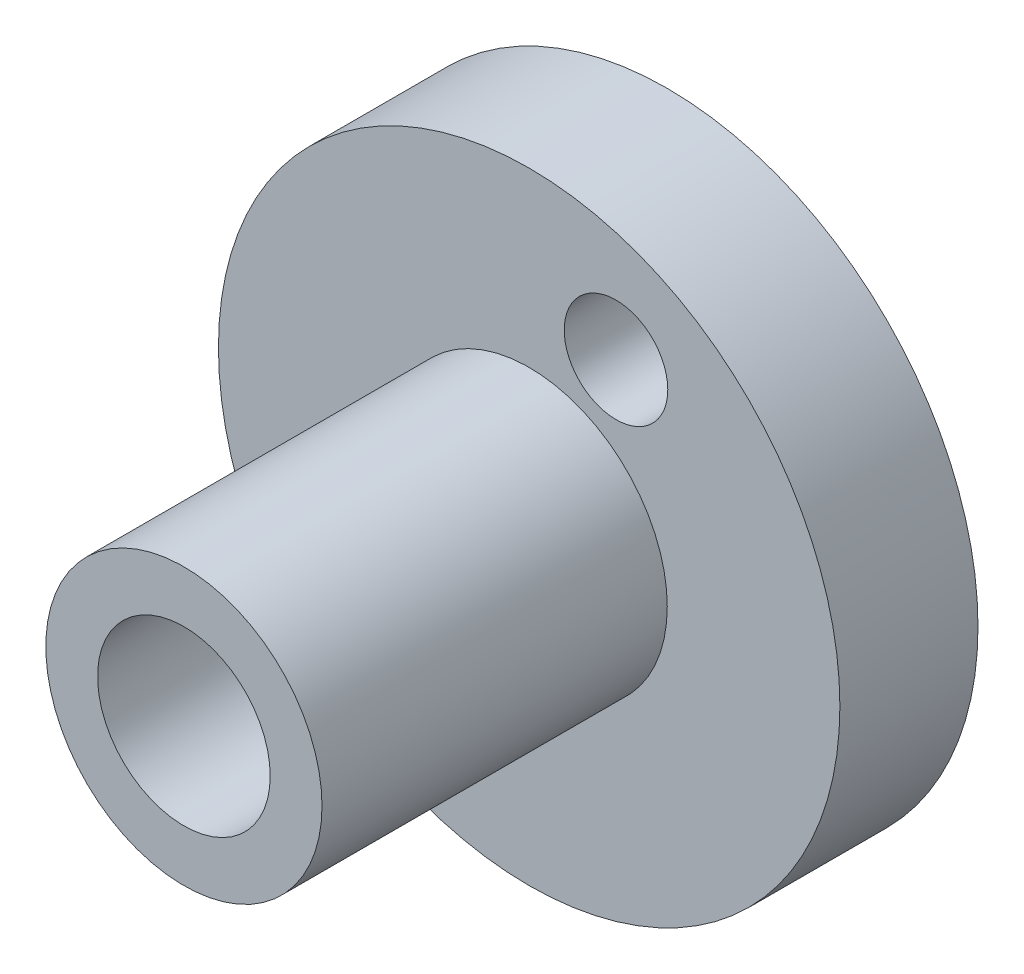
ISO-10303-21;
HEADER;
FILE_DESCRIPTION(('STEP AP214'),'2;1');
FILE_NAME('part.step','',(''),(''),'','','');
FILE_SCHEMA(('AUTOMOTIVE_DESIGN { 1 0 10303 214 1 1 1 1 }'));
ENDSEC;
DATA;
#1=APPLICATION_CONTEXT('core data for automotive mechanical design processes');
#2=APPLICATION_PROTOCOL_DEFINITION('international standard','automotive_design',2000,#1);
#3=PRODUCT_CONTEXT('',#1,'mechanical');
#4=PRODUCT('Part','Part','',(#3));
#5=PRODUCT_RELATED_PRODUCT_CATEGORY('part','',(#4));
#6=PRODUCT_DEFINITION_FORMATION('','',#4);
#7=PRODUCT_DEFINITION_CONTEXT('part definition',#1,'design');
#8=PRODUCT_DEFINITION('design','',#6,#7);
#9=PRODUCT_DEFINITION_SHAPE('','',#8);
#10=(LENGTH_UNIT() NAMED_UNIT(*) SI_UNIT(.MILLI.,.METRE.));
#11=(NAMED_UNIT(*) PLANE_ANGLE_UNIT() SI_UNIT($,.RADIAN.));
#12=(NAMED_UNIT(*) SI_UNIT($,.STERADIAN.) SOLID_ANGLE_UNIT());
#13=UNCERTAINTY_MEASURE_WITH_UNIT(LENGTH_MEASURE(1.E-05),#10,'distance_accuracy_value','');
#14=(GEOMETRIC_REPRESENTATION_CONTEXT(3) GLOBAL_UNCERTAINTY_ASSIGNED_CONTEXT((#13)) GLOBAL_UNIT_ASSIGNED_CONTEXT((#10,
#11,#12)) REPRESENTATION_CONTEXT('',''));
#15=CARTESIAN_POINT('',(0.,0.,0.));
#16=DIRECTION('',(0.,0.,1.));
#17=DIRECTION('',(1.,0.,0.));
#18=AXIS2_PLACEMENT_3D('',#15,#16,#17);
#19=CARTESIAN_POINT('',(0.,0.,8.));
#20=DIRECTION('',(0.,0.,1.));
#21=DIRECTION('',(1.,0.,0.));
#22=AXIS2_PLACEMENT_3D('',#19,#20,#21);
#23=PLANE('',#22);
#24=CARTESIAN_POINT('',(5.02954060508299,10.8951237396287,8.));
#25=DIRECTION('',(0.,0.,1.));
#26=DIRECTION('',(1.,0.,0.));
#27=AXIS2_PLACEMENT_3D('',#24,#25,#26);
#28=CIRCLE('',#27,3.);
#29=CARTESIAN_POINT('',(8.02954060508299,10.8951237396287,8.));
#30=VERTEX_POINT('',#29);
#31=EDGE_CURVE('E75',#30,#30,#28,.T.);
#32=ORIENTED_EDGE('',*,*,#31,.F.);
#33=EDGE_LOOP('',(#32));
#34=FACE_BOUND('',#33,.T.);
#35=CARTESIAN_POINT('',(-5.02954060508299,-10.8951237396287,8.));
#36=DIRECTION('',(0.,0.,1.));
#37=DIRECTION('',(1.,0.,0.));
#38=AXIS2_PLACEMENT_3D('',#35,#36,#37);
#39=CIRCLE('',#38,3.);
#40=CARTESIAN_POINT('',(-2.02954060508299,-10.8951237396287,8.));
#41=VERTEX_POINT('',#40);
#42=EDGE_CURVE('E67',#41,#41,#39,.T.);
#43=ORIENTED_EDGE('',*,*,#42,.F.);
#44=EDGE_LOOP('',(#43));
#45=FACE_BOUND('',#44,.T.);
#46=CARTESIAN_POINT('',(0.,0.,8.));
#47=DIRECTION('',(0.,0.,1.));
#48=DIRECTION('',(1.,0.,0.));
#49=AXIS2_PLACEMENT_3D('',#46,#47,#48);
#50=CIRCLE('',#49,18.);
#51=CARTESIAN_POINT('',(18.,0.,8.));
#52=VERTEX_POINT('',#51);
#53=EDGE_CURVE('E10',#52,#52,#50,.T.);
#54=ORIENTED_EDGE('',*,*,#53,.T.);
#55=EDGE_LOOP('',(#54));
#56=FACE_BOUND('',#55,.T.);
#57=CARTESIAN_POINT('',(0.,0.,8.));
#58=DIRECTION('',(0.,0.,1.));
#59=DIRECTION('',(1.,0.,0.));
#60=AXIS2_PLACEMENT_3D('',#57,#58,#59);
#61=CIRCLE('',#60,8.);
#62=CARTESIAN_POINT('',(8.,0.,8.));
#63=VERTEX_POINT('',#62);
#64=EDGE_CURVE('E56',#63,#63,#61,.T.);
#65=ORIENTED_EDGE('',*,*,#64,.F.);
#66=EDGE_LOOP('',(#65));
#67=FACE_BOUND('',#66,.T.);
#68=ADVANCED_FACE('F37',(#34,#45,#56,#67),#23,.T.);
#69=CARTESIAN_POINT('',(0.,0.,0.));
#70=DIRECTION('',(0.,0.,1.));
#71=DIRECTION('',(1.,0.,0.));
#72=AXIS2_PLACEMENT_3D('',#69,#70,#71);
#73=PLANE('',#72);
#74=CARTESIAN_POINT('',(5.02954060508299,10.8951237396287,0.));
#75=DIRECTION('',(0.,0.,-1.));
#76=DIRECTION('',(1.,0.,0.));
#77=AXIS2_PLACEMENT_3D('',#74,#75,#76);
#78=CIRCLE('',#77,3.);
#79=CARTESIAN_POINT('',(8.02954060508299,10.8951237396287,0.));
#80=VERTEX_POINT('',#79);
#81=EDGE_CURVE('E79',#80,#80,#78,.T.);
#82=ORIENTED_EDGE('',*,*,#81,.F.);
#83=EDGE_LOOP('',(#82));
#84=FACE_BOUND('',#83,.T.);
#85=CARTESIAN_POINT('',(-5.02954060508299,-10.8951237396287,0.));
#86=DIRECTION('',(0.,0.,-1.));
#87=DIRECTION('',(-1.,0.,0.));
#88=AXIS2_PLACEMENT_3D('',#85,#86,#87);
#89=CIRCLE('',#88,3.);
#90=CARTESIAN_POINT('',(-8.02954060508299,-10.8951237396287,0.));
#91=VERTEX_POINT('',#90);
#92=EDGE_CURVE('E71',#91,#91,#89,.T.);
#93=ORIENTED_EDGE('',*,*,#92,.F.);
#94=EDGE_LOOP('',(#93));
#95=FACE_BOUND('',#94,.T.);
#96=CARTESIAN_POINT('',(0.,0.,0.));
#97=DIRECTION('',(0.,0.,1.));
#98=DIRECTION('',(1.,0.,0.));
#99=AXIS2_PLACEMENT_3D('',#96,#97,#98);
#100=CIRCLE('',#99,18.);
#101=CARTESIAN_POINT('',(18.,0.,0.));
#102=VERTEX_POINT('',#101);
#103=EDGE_CURVE('E41',#102,#102,#100,.T.);
#104=ORIENTED_EDGE('',*,*,#103,.F.);
#105=EDGE_LOOP('',(#104));
#106=FACE_BOUND('',#105,.T.);
#107=CARTESIAN_POINT('',(0.,0.,0.));
#108=DIRECTION('',(0.,0.,1.));
#109=DIRECTION('',(1.,0.,0.));
#110=AXIS2_PLACEMENT_3D('',#107,#108,#109);
#111=CIRCLE('',#110,5.);
#112=CARTESIAN_POINT('',(5.,0.,0.));
#113=VERTEX_POINT('',#112);
#114=EDGE_CURVE('E50',#113,#113,#111,.T.);
#115=ORIENTED_EDGE('',*,*,#114,.T.);
#116=EDGE_LOOP('',(#115));
#117=FACE_BOUND('',#116,.T.);
#118=ADVANCED_FACE('F86',(#84,#95,#106,#117),#73,.F.);
#119=CARTESIAN_POINT('',(0.,0.,8.));
#120=DIRECTION('',(0.,0.,-1.));
#121=DIRECTION('',(-1.,0.,0.));
#122=AXIS2_PLACEMENT_3D('',#119,#120,#121);
#123=CYLINDRICAL_SURFACE('',#122,18.);
#124=ORIENTED_EDGE('',*,*,#53,.F.);
#125=EDGE_LOOP('',(#124));
#126=FACE_BOUND('',#125,.T.);
#127=ORIENTED_EDGE('',*,*,#103,.T.);
#128=EDGE_LOOP('',(#127));
#129=FACE_BOUND('',#128,.T.);
#130=ADVANCED_FACE('F39',(#126,#129),#123,.T.);
#131=CARTESIAN_POINT('',(0.,0.,8.));
#132=DIRECTION('',(0.,0.,-1.));
#133=DIRECTION('',(-1.,0.,0.));
#134=AXIS2_PLACEMENT_3D('',#131,#132,#133);
#135=CYLINDRICAL_SURFACE('',#134,5.);
#136=ORIENTED_EDGE('',*,*,#114,.F.);
#137=EDGE_LOOP('',(#136));
#138=FACE_BOUND('',#137,.T.);
#139=CARTESIAN_POINT('',(0.,0.,28.));
#140=DIRECTION('',(0.,0.,1.));
#141=DIRECTION('',(1.,0.,0.));
#142=AXIS2_PLACEMENT_3D('',#139,#140,#141);
#143=CIRCLE('',#142,5.);
#144=CARTESIAN_POINT('',(5.,0.,28.));
#145=VERTEX_POINT('',#144);
#146=EDGE_CURVE('E60',#145,#145,#143,.T.);
#147=ORIENTED_EDGE('',*,*,#146,.T.);
#148=EDGE_LOOP('',(#147));
#149=FACE_BOUND('',#148,.T.);
#150=ADVANCED_FACE('F95',(#138,#149),#135,.F.);
#151=CARTESIAN_POINT('',(0.,0.,28.));
#152=DIRECTION('',(0.,0.,1.));
#153=DIRECTION('',(1.,0.,0.));
#154=AXIS2_PLACEMENT_3D('',#151,#152,#153);
#155=PLANE('',#154);
#156=CARTESIAN_POINT('',(0.,0.,28.));
#157=DIRECTION('',(0.,0.,1.));
#158=DIRECTION('',(1.,0.,0.));
#159=AXIS2_PLACEMENT_3D('',#156,#157,#158);
#160=CIRCLE('',#159,8.);
#161=CARTESIAN_POINT('',(8.,0.,28.));
#162=VERTEX_POINT('',#161);
#163=EDGE_CURVE('E55',#162,#162,#160,.T.);
#164=ORIENTED_EDGE('',*,*,#163,.T.);
#165=EDGE_LOOP('',(#164));
#166=FACE_BOUND('',#165,.T.);
#167=ORIENTED_EDGE('',*,*,#146,.F.);
#168=EDGE_LOOP('',(#167));
#169=FACE_BOUND('',#168,.T.);
#170=ADVANCED_FACE('F98',(#166,#169),#155,.T.);
#171=CARTESIAN_POINT('',(0.,0.,28.));
#172=DIRECTION('',(0.,0.,-1.));
#173=DIRECTION('',(-1.,0.,0.));
#174=AXIS2_PLACEMENT_3D('',#171,#172,#173);
#175=CYLINDRICAL_SURFACE('',#174,8.);
#176=ORIENTED_EDGE('',*,*,#163,.F.);
#177=EDGE_LOOP('',(#176));
#178=FACE_BOUND('',#177,.T.);
#179=ORIENTED_EDGE('',*,*,#64,.T.);
#180=EDGE_LOOP('',(#179));
#181=FACE_BOUND('',#180,.T.);
#182=ADVANCED_FACE('F103',(#178,#181),#175,.T.);
#183=CARTESIAN_POINT('',(-5.02954060508299,-10.8951237396287,20.));
#184=DIRECTION('',(0.,0.,-1.));
#185=DIRECTION('',(-1.,0.,0.));
#186=AXIS2_PLACEMENT_3D('',#183,#184,#185);
#187=CYLINDRICAL_SURFACE('',#186,3.);
#188=ORIENTED_EDGE('',*,*,#42,.T.);
#189=EDGE_LOOP('',(#188));
#190=FACE_BOUND('',#189,.T.);
#191=ORIENTED_EDGE('',*,*,#92,.T.);
#192=EDGE_LOOP('',(#191));
#193=FACE_BOUND('',#192,.T.);
#194=ADVANCED_FACE('F109',(#190,#193),#187,.F.);
#195=CARTESIAN_POINT('',(5.02954060508299,10.8951237396287,20.));
#196=DIRECTION('',(0.,0.,-1.));
#197=DIRECTION('',(-1.,0.,0.));
#198=AXIS2_PLACEMENT_3D('',#195,#196,#197);
#199=CYLINDRICAL_SURFACE('',#198,3.);
#200=ORIENTED_EDGE('',*,*,#31,.T.);
#201=EDGE_LOOP('',(#200));
#202=FACE_BOUND('',#201,.T.);
#203=ORIENTED_EDGE('',*,*,#81,.T.);
#204=EDGE_LOOP('',(#203));
#205=FACE_BOUND('',#204,.T.);
#206=ADVANCED_FACE('F84',(#202,#205),#199,.F.);
#207=CLOSED_SHELL('',(#68,#118,#130,#150,#170,#182,#194,#206));
#208=MANIFOLD_SOLID_BREP('B2',#207);
#209=ADVANCED_BREP_SHAPE_REPRESENTATION('',(#18,#208),#14);
#210=SHAPE_DEFINITION_REPRESENTATION(#9,#209);
ENDSEC;
END-ISO-10303-21;
